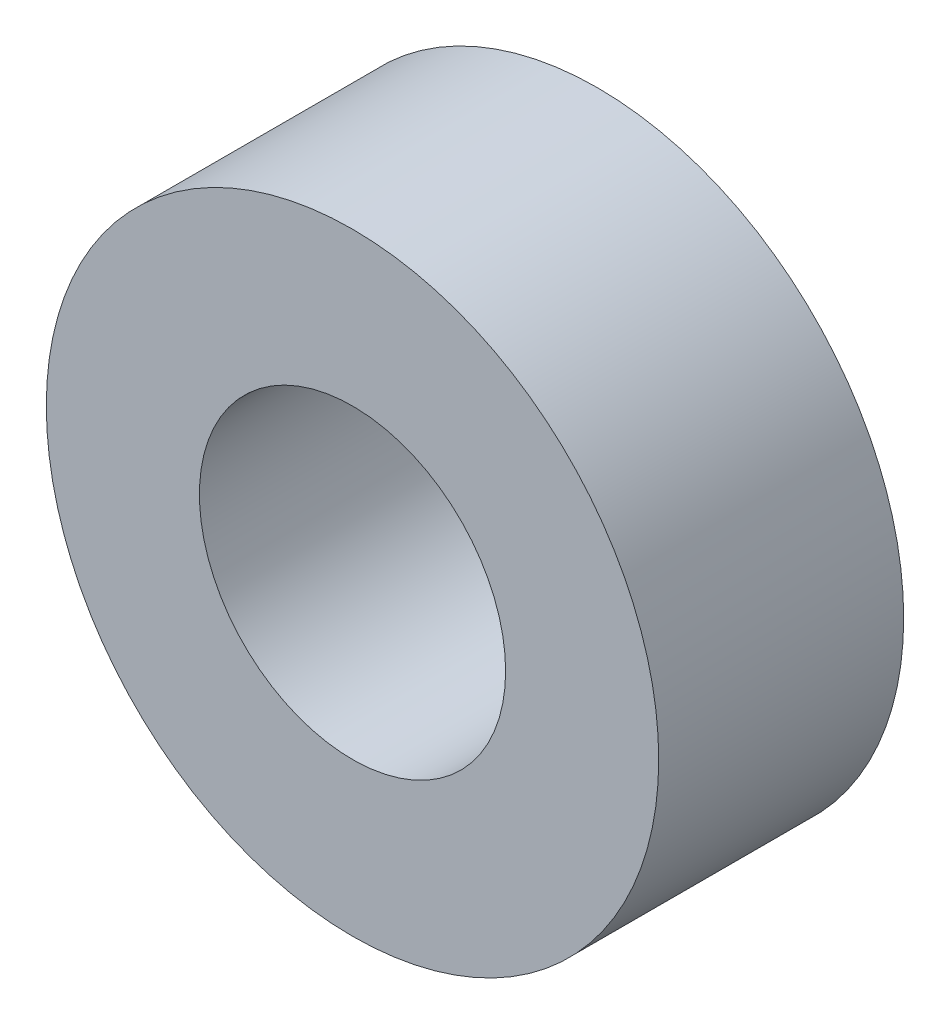
ISO-10303-21;
HEADER;
FILE_DESCRIPTION(('STEP AP214'),'2;1');
FILE_NAME('part.step','',(''),(''),'','','');
FILE_SCHEMA(('AUTOMOTIVE_DESIGN { 1 0 10303 214 1 1 1 1 }'));
ENDSEC;
DATA;
#1=APPLICATION_CONTEXT('core data for automotive mechanical design processes');
#2=APPLICATION_PROTOCOL_DEFINITION('international standard','automotive_design',2000,#1);
#3=PRODUCT_CONTEXT('',#1,'mechanical');
#4=PRODUCT('Part','Part','',(#3));
#5=PRODUCT_RELATED_PRODUCT_CATEGORY('part','',(#4));
#6=PRODUCT_DEFINITION_FORMATION('','',#4);
#7=PRODUCT_DEFINITION_CONTEXT('part definition',#1,'design');
#8=PRODUCT_DEFINITION('design','',#6,#7);
#9=PRODUCT_DEFINITION_SHAPE('','',#8);
#10=(LENGTH_UNIT() NAMED_UNIT(*) SI_UNIT(.MILLI.,.METRE.));
#11=(NAMED_UNIT(*) PLANE_ANGLE_UNIT() SI_UNIT($,.RADIAN.));
#12=(NAMED_UNIT(*) SI_UNIT($,.STERADIAN.) SOLID_ANGLE_UNIT());
#13=UNCERTAINTY_MEASURE_WITH_UNIT(LENGTH_MEASURE(1.E-05),#10,'distance_accuracy_value','');
#14=(GEOMETRIC_REPRESENTATION_CONTEXT(3) GLOBAL_UNCERTAINTY_ASSIGNED_CONTEXT((#13)) GLOBAL_UNIT_ASSIGNED_CONTEXT((#10,
#11,#12)) REPRESENTATION_CONTEXT('',''));
#15=CARTESIAN_POINT('',(0.,0.,0.));
#16=DIRECTION('',(0.,0.,1.));
#17=DIRECTION('',(1.,0.,0.));
#18=AXIS2_PLACEMENT_3D('',#15,#16,#17);
#19=CARTESIAN_POINT('',(0.,0.,4.));
#20=DIRECTION('',(0.,0.,1.));
#21=DIRECTION('',(1.,0.,0.));
#22=AXIS2_PLACEMENT_3D('',#19,#20,#21);
#23=PLANE('',#22);
#24=CARTESIAN_POINT('',(0.,0.,4.));
#25=DIRECTION('',(0.,0.,1.));
#26=DIRECTION('',(1.,0.,0.));
#27=AXIS2_PLACEMENT_3D('',#24,#25,#26);
#28=CIRCLE('',#27,5.);
#29=CARTESIAN_POINT('',(5.,0.,4.));
#30=VERTEX_POINT('',#29);
#31=EDGE_CURVE('E10',#30,#30,#28,.T.);
#32=ORIENTED_EDGE('',*,*,#31,.T.);
#33=EDGE_LOOP('',(#32));
#34=FACE_BOUND('',#33,.T.);
#35=CARTESIAN_POINT('',(0.,0.,4.));
#36=DIRECTION('',(0.,0.,1.));
#37=DIRECTION('',(1.,0.,0.));
#38=AXIS2_PLACEMENT_3D('',#35,#36,#37);
#39=CIRCLE('',#38,2.5);
#40=CARTESIAN_POINT('',(2.5,0.,4.));
#41=VERTEX_POINT('',#40);
#42=EDGE_CURVE('E47',#41,#41,#39,.T.);
#43=ORIENTED_EDGE('',*,*,#42,.F.);
#44=EDGE_LOOP('',(#43));
#45=FACE_BOUND('',#44,.T.);
#46=ADVANCED_FACE('F36',(#34,#45),#23,.T.);
#47=CARTESIAN_POINT('',(0.,0.,0.));
#48=DIRECTION('',(0.,0.,1.));
#49=DIRECTION('',(1.,0.,0.));
#50=AXIS2_PLACEMENT_3D('',#47,#48,#49);
#51=PLANE('',#50);
#52=CARTESIAN_POINT('',(0.,0.,0.));
#53=DIRECTION('',(0.,0.,1.));
#54=DIRECTION('',(1.,0.,0.));
#55=AXIS2_PLACEMENT_3D('',#52,#53,#54);
#56=CIRCLE('',#55,5.);
#57=CARTESIAN_POINT('',(5.,0.,0.));
#58=VERTEX_POINT('',#57);
#59=EDGE_CURVE('E40',#58,#58,#56,.T.);
#60=ORIENTED_EDGE('',*,*,#59,.F.);
#61=EDGE_LOOP('',(#60));
#62=FACE_BOUND('',#61,.T.);
#63=CARTESIAN_POINT('',(0.,0.,0.));
#64=DIRECTION('',(0.,0.,1.));
#65=DIRECTION('',(1.,0.,0.));
#66=AXIS2_PLACEMENT_3D('',#63,#64,#65);
#67=CIRCLE('',#66,2.5);
#68=CARTESIAN_POINT('',(2.5,0.,0.));
#69=VERTEX_POINT('',#68);
#70=EDGE_CURVE('E49',#69,#69,#67,.T.);
#71=ORIENTED_EDGE('',*,*,#70,.T.);
#72=EDGE_LOOP('',(#71));
#73=FACE_BOUND('',#72,.T.);
#74=ADVANCED_FACE('F59',(#62,#73),#51,.F.);
#75=CARTESIAN_POINT('',(0.,0.,4.));
#76=DIRECTION('',(0.,0.,-1.));
#77=DIRECTION('',(-1.,0.,0.));
#78=AXIS2_PLACEMENT_3D('',#75,#76,#77);
#79=CYLINDRICAL_SURFACE('',#78,5.);
#80=ORIENTED_EDGE('',*,*,#31,.F.);
#81=EDGE_LOOP('',(#80));
#82=FACE_BOUND('',#81,.T.);
#83=ORIENTED_EDGE('',*,*,#59,.T.);
#84=EDGE_LOOP('',(#83));
#85=FACE_BOUND('',#84,.T.);
#86=ADVANCED_FACE('F38',(#82,#85),#79,.T.);
#87=CARTESIAN_POINT('',(0.,0.,4.));
#88=DIRECTION('',(0.,0.,-1.));
#89=DIRECTION('',(-1.,0.,0.));
#90=AXIS2_PLACEMENT_3D('',#87,#88,#89);
#91=CYLINDRICAL_SURFACE('',#90,2.5);
#92=ORIENTED_EDGE('',*,*,#42,.T.);
#93=EDGE_LOOP('',(#92));
#94=FACE_BOUND('',#93,.T.);
#95=ORIENTED_EDGE('',*,*,#70,.F.);
#96=EDGE_LOOP('',(#95));
#97=FACE_BOUND('',#96,.T.);
#98=ADVANCED_FACE('F55',(#94,#97),#91,.F.);
#99=CLOSED_SHELL('',(#46,#74,#86,#98));
#100=MANIFOLD_SOLID_BREP('B2',#99);
#101=ADVANCED_BREP_SHAPE_REPRESENTATION('',(#18,#100),#14);
#102=SHAPE_DEFINITION_REPRESENTATION(#9,#101);
ENDSEC;
END-ISO-10303-21;
